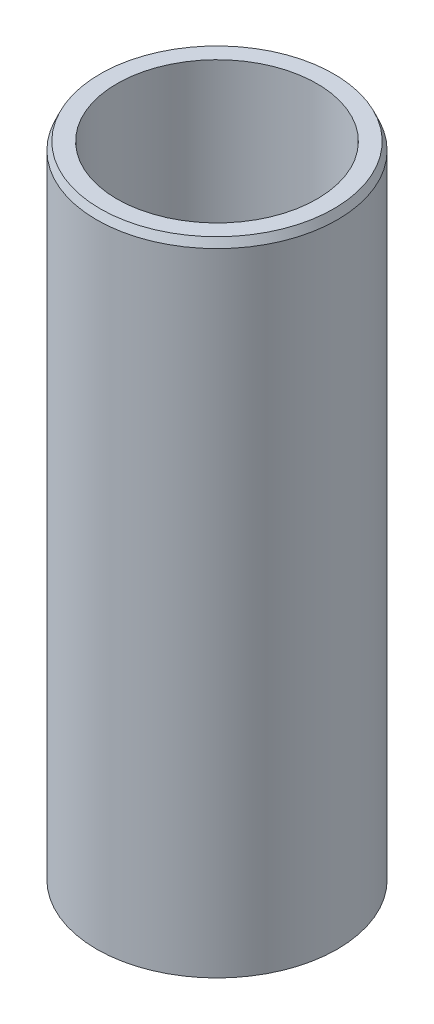
ISO-10303-21;
HEADER;
FILE_DESCRIPTION(('STEP AP214'),'2;1');
FILE_NAME('part.step','',(''),(''),'','','');
FILE_SCHEMA(('AUTOMOTIVE_DESIGN { 1 0 10303 214 1 1 1 1 }'));
ENDSEC;
DATA;
#1=APPLICATION_CONTEXT('core data for automotive mechanical design processes');
#2=APPLICATION_PROTOCOL_DEFINITION('international standard','automotive_design',2000,#1);
#3=PRODUCT_CONTEXT('',#1,'mechanical');
#4=PRODUCT('Part','Part','',(#3));
#5=PRODUCT_RELATED_PRODUCT_CATEGORY('part','',(#4));
#6=PRODUCT_DEFINITION_FORMATION('','',#4);
#7=PRODUCT_DEFINITION_CONTEXT('part definition',#1,'design');
#8=PRODUCT_DEFINITION('design','',#6,#7);
#9=PRODUCT_DEFINITION_SHAPE('','',#8);
#10=(LENGTH_UNIT() NAMED_UNIT(*) SI_UNIT(.MILLI.,.METRE.));
#11=(NAMED_UNIT(*) PLANE_ANGLE_UNIT() SI_UNIT($,.RADIAN.));
#12=(NAMED_UNIT(*) SI_UNIT($,.STERADIAN.) SOLID_ANGLE_UNIT());
#13=UNCERTAINTY_MEASURE_WITH_UNIT(LENGTH_MEASURE(1.E-05),#10,'distance_accuracy_value','');
#14=(GEOMETRIC_REPRESENTATION_CONTEXT(3) GLOBAL_UNCERTAINTY_ASSIGNED_CONTEXT((#13)) GLOBAL_UNIT_ASSIGNED_CONTEXT((#10,
#11,#12)) REPRESENTATION_CONTEXT('',''));
#15=CARTESIAN_POINT('',(0.,0.,0.));
#16=DIRECTION('',(0.,0.,1.));
#17=DIRECTION('',(1.,0.,0.));
#18=AXIS2_PLACEMENT_3D('',#15,#16,#17);
#19=CARTESIAN_POINT('',(0.,293.954693320728,0.));
#20=DIRECTION('',(0.,-1.,0.));
#21=DIRECTION('',(0.,0.,-1.));
#22=AXIS2_PLACEMENT_3D('',#19,#20,#21);
#23=CYLINDRICAL_SURFACE('',#22,55.);
#24=CARTESIAN_POINT('',(0.,290.355204557953,0.));
#25=DIRECTION('',(0.,1.,0.));
#26=DIRECTION('',(0.,0.,1.));
#27=AXIS2_PLACEMENT_3D('',#24,#25,#26);
#28=CIRCLE('',#27,55.);
#29=CARTESIAN_POINT('',(0.,290.355204557953,55.));
#30=VERTEX_POINT('',#29);
#31=EDGE_CURVE('E50',#30,#30,#28,.F.);
#32=ORIENTED_EDGE('',*,*,#31,.T.);
#33=EDGE_LOOP('',(#32));
#34=FACE_BOUND('',#33,.T.);
#35=CARTESIAN_POINT('',(0.,1.5837648982378,0.));
#36=DIRECTION('',(0.,1.,0.));
#37=DIRECTION('',(0.,0.,1.));
#38=AXIS2_PLACEMENT_3D('',#35,#36,#37);
#39=CIRCLE('',#38,55.);
#40=CARTESIAN_POINT('',(0.,1.5837648982378,55.));
#41=VERTEX_POINT('',#40);
#42=EDGE_CURVE('E51',#41,#41,#39,.T.);
#43=ORIENTED_EDGE('',*,*,#42,.T.);
#44=EDGE_LOOP('',(#43));
#45=FACE_BOUND('',#44,.T.);
#46=ADVANCED_FACE('F39',(#34,#45),#23,.T.);
#47=CARTESIAN_POINT('',(0.,293.954693320728,0.));
#48=DIRECTION('',(0.,1.,0.));
#49=DIRECTION('',(0.,0.,1.));
#50=AXIS2_PLACEMENT_3D('',#47,#48,#49);
#51=PLANE('',#50);
#52=CARTESIAN_POINT('',(0.,293.954693320728,0.));
#53=DIRECTION('',(0.,1.,0.));
#54=DIRECTION('',(0.,0.,1.));
#55=AXIS2_PLACEMENT_3D('',#52,#53,#54);
#56=CIRCLE('',#55,53.4162351017621);
#57=CARTESIAN_POINT('',(0.,293.954693320728,53.4162351017621));
#58=VERTEX_POINT('',#57);
#59=EDGE_CURVE('E54',#58,#58,#56,.T.);
#60=ORIENTED_EDGE('',*,*,#59,.T.);
#61=EDGE_LOOP('',(#60));
#62=FACE_BOUND('',#61,.T.);
#63=CARTESIAN_POINT('',(0.,293.954693320728,0.));
#64=DIRECTION('',(0.,1.,0.));
#65=DIRECTION('',(0.,0.,1.));
#66=AXIS2_PLACEMENT_3D('',#63,#64,#65);
#67=CIRCLE('',#66,45.7148817576541);
#68=CARTESIAN_POINT('',(0.,293.954693320728,45.7148817576541));
#69=VERTEX_POINT('',#68);
#70=EDGE_CURVE('E58',#69,#69,#67,.T.);
#71=ORIENTED_EDGE('',*,*,#70,.F.);
#72=EDGE_LOOP('',(#71));
#73=FACE_BOUND('',#72,.T.);
#74=ADVANCED_FACE('F69',(#62,#73),#51,.T.);
#75=CARTESIAN_POINT('',(0.,0.,0.));
#76=DIRECTION('',(0.,1.,0.));
#77=DIRECTION('',(0.,0.,1.));
#78=AXIS2_PLACEMENT_3D('',#75,#76,#77);
#79=PLANE('',#78);
#80=CARTESIAN_POINT('',(0.,0.,0.));
#81=DIRECTION('',(0.,1.,0.));
#82=DIRECTION('',(0.,0.,1.));
#83=AXIS2_PLACEMENT_3D('',#80,#81,#82);
#84=CIRCLE('',#83,51.4005112372252);
#85=CARTESIAN_POINT('',(0.,0.,51.4005112372252));
#86=VERTEX_POINT('',#85);
#87=EDGE_CURVE('E10',#86,#86,#84,.F.);
#88=ORIENTED_EDGE('',*,*,#87,.T.);
#89=EDGE_LOOP('',(#88));
#90=FACE_BOUND('',#89,.T.);
#91=CARTESIAN_POINT('',(0.,0.,0.));
#92=DIRECTION('',(0.,1.,0.));
#93=DIRECTION('',(0.,0.,1.));
#94=AXIS2_PLACEMENT_3D('',#91,#92,#93);
#95=CIRCLE('',#94,45.7148817576541);
#96=CARTESIAN_POINT('',(0.,0.,45.7148817576541));
#97=VERTEX_POINT('',#96);
#98=EDGE_CURVE('E63',#97,#97,#95,.T.);
#99=ORIENTED_EDGE('',*,*,#98,.T.);
#100=EDGE_LOOP('',(#99));
#101=FACE_BOUND('',#100,.T.);
#102=ADVANCED_FACE('F75',(#90,#101),#79,.F.);
#103=CARTESIAN_POINT('',(0.,293.954693320728,0.));
#104=DIRECTION('',(0.,-1.,0.));
#105=DIRECTION('',(0.,0.,-1.));
#106=AXIS2_PLACEMENT_3D('',#103,#104,#105);
#107=CYLINDRICAL_SURFACE('',#106,45.7148817576541);
#108=ORIENTED_EDGE('',*,*,#70,.T.);
#109=EDGE_LOOP('',(#108));
#110=FACE_BOUND('',#109,.T.);
#111=ORIENTED_EDGE('',*,*,#98,.F.);
#112=EDGE_LOOP('',(#111));
#113=FACE_BOUND('',#112,.T.);
#114=ADVANCED_FACE('F70',(#110,#113),#107,.F.);
#115=CARTESIAN_POINT('',(0.,293.954693320728,0.));
#116=DIRECTION('',(0.,-1.,0.));
#117=DIRECTION('',(0.,0.,-1.));
#118=AXIS2_PLACEMENT_3D('',#115,#116,#117);
#119=CONICAL_SURFACE('',#118,53.4162351017621,0.414504510393298);
#120=ORIENTED_EDGE('',*,*,#31,.F.);
#121=EDGE_LOOP('',(#120));
#122=FACE_BOUND('',#121,.T.);
#123=ORIENTED_EDGE('',*,*,#59,.F.);
#124=EDGE_LOOP('',(#123));
#125=FACE_BOUND('',#124,.T.);
#126=ADVANCED_FACE('F81',(#122,#125),#119,.T.);
#127=CARTESIAN_POINT('',(0.,1.5837648982378,0.));
#128=DIRECTION('',(0.,1.,0.));
#129=DIRECTION('',(0.,0.,1.));
#130=AXIS2_PLACEMENT_3D('',#127,#128,#129);
#131=CONICAL_SURFACE('',#130,55.,1.15629181640161);
#132=ORIENTED_EDGE('',*,*,#87,.F.);
#133=EDGE_LOOP('',(#132));
#134=FACE_BOUND('',#133,.T.);
#135=ORIENTED_EDGE('',*,*,#42,.F.);
#136=EDGE_LOOP('',(#135));
#137=FACE_BOUND('',#136,.T.);
#138=ADVANCED_FACE('F45',(#134,#137),#131,.T.);
#139=CLOSED_SHELL('',(#46,#74,#102,#114,#126,#138));
#140=MANIFOLD_SOLID_BREP('B2',#139);
#141=ADVANCED_BREP_SHAPE_REPRESENTATION('',(#18,#140),#14);
#142=SHAPE_DEFINITION_REPRESENTATION(#9,#141);
ENDSEC;
END-ISO-10303-21;
